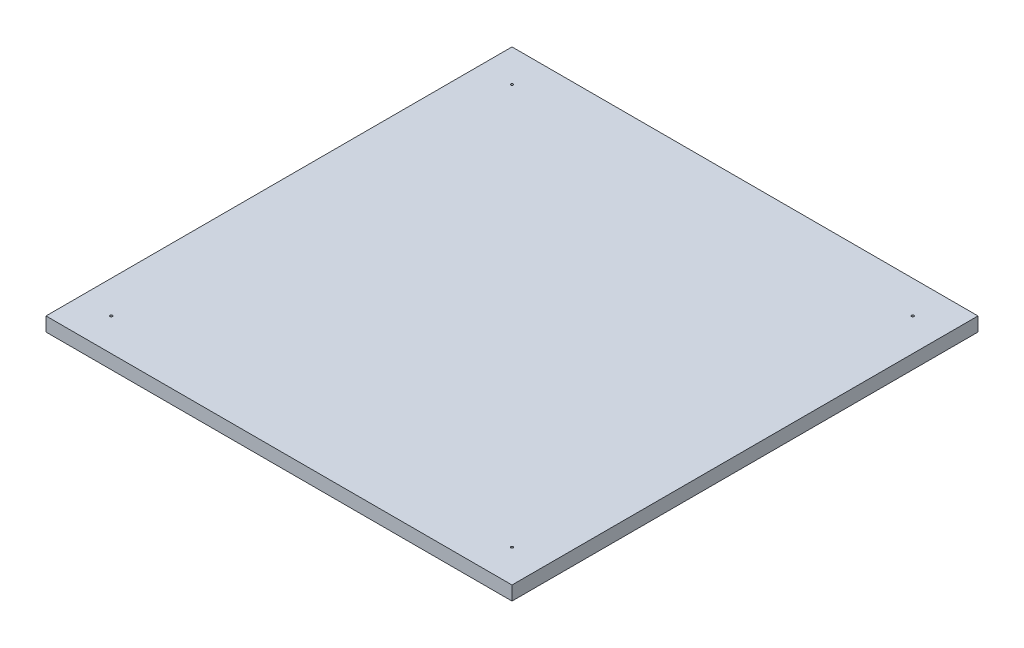
ISO-10303-21;
HEADER;
FILE_DESCRIPTION(('STEP AP214'),'2;1');
FILE_NAME('part.step','',(''),(''),'','','');
FILE_SCHEMA(('AUTOMOTIVE_DESIGN { 1 0 10303 214 1 1 1 1 }'));
ENDSEC;
DATA;
#1=APPLICATION_CONTEXT('core data for automotive mechanical design processes');
#2=APPLICATION_PROTOCOL_DEFINITION('international standard','automotive_design',2000,#1);
#3=PRODUCT_CONTEXT('',#1,'mechanical');
#4=PRODUCT('Part','Part','',(#3));
#5=PRODUCT_RELATED_PRODUCT_CATEGORY('part','',(#4));
#6=PRODUCT_DEFINITION_FORMATION('','',#4);
#7=PRODUCT_DEFINITION_CONTEXT('part definition',#1,'design');
#8=PRODUCT_DEFINITION('design','',#6,#7);
#9=PRODUCT_DEFINITION_SHAPE('','',#8);
#10=(LENGTH_UNIT() NAMED_UNIT(*) SI_UNIT(.MILLI.,.METRE.));
#11=(NAMED_UNIT(*) PLANE_ANGLE_UNIT() SI_UNIT($,.RADIAN.));
#12=(NAMED_UNIT(*) SI_UNIT($,.STERADIAN.) SOLID_ANGLE_UNIT());
#13=UNCERTAINTY_MEASURE_WITH_UNIT(LENGTH_MEASURE(1.E-05),#10,'distance_accuracy_value','');
#14=(GEOMETRIC_REPRESENTATION_CONTEXT(3) GLOBAL_UNCERTAINTY_ASSIGNED_CONTEXT((#13)) GLOBAL_UNIT_ASSIGNED_CONTEXT((#10,
#11,#12)) REPRESENTATION_CONTEXT('',''));
#15=CARTESIAN_POINT('',(0.,0.,0.));
#16=DIRECTION('',(0.,0.,1.));
#17=DIRECTION('',(1.,0.,0.));
#18=AXIS2_PLACEMENT_3D('',#15,#16,#17);
#19=CARTESIAN_POINT('',(500.,30.,0.));
#20=DIRECTION('',(0.,0.,-1.));
#21=DIRECTION('',(0.,1.,0.));
#22=AXIS2_PLACEMENT_3D('',#19,#20,#21);
#23=PLANE('',#22);
#24=DIRECTION('',(0.,-1.,0.));
#25=VECTOR('',#24,1.);
#26=CARTESIAN_POINT('',(-500.,30.,0.));
#27=LINE('',#26,#25);
#28=CARTESIAN_POINT('',(-500.,30.,0.));
#29=VERTEX_POINT('',#28);
#30=CARTESIAN_POINT('',(-500.,0.,0.));
#31=VERTEX_POINT('',#30);
#32=EDGE_CURVE('E97',#29,#31,#27,.T.);
#33=ORIENTED_EDGE('',*,*,#32,.T.);
#34=DIRECTION('',(-1.,0.,0.));
#35=VECTOR('',#34,1.);
#36=CARTESIAN_POINT('',(500.,0.,0.));
#37=LINE('',#36,#35);
#38=CARTESIAN_POINT('',(500.,0.,0.));
#39=VERTEX_POINT('',#38);
#40=EDGE_CURVE('E11',#39,#31,#37,.T.);
#41=ORIENTED_EDGE('',*,*,#40,.F.);
#42=DIRECTION('',(0.,-1.,0.));
#43=VECTOR('',#42,1.);
#44=CARTESIAN_POINT('',(500.,30.,0.));
#45=LINE('',#44,#43);
#46=CARTESIAN_POINT('',(500.,30.,0.));
#47=VERTEX_POINT('',#46);
#48=EDGE_CURVE('E85',#47,#39,#45,.T.);
#49=ORIENTED_EDGE('',*,*,#48,.F.);
#50=DIRECTION('',(-1.,0.,0.));
#51=VECTOR('',#50,1.);
#52=CARTESIAN_POINT('',(500.,30.,0.));
#53=LINE('',#52,#51);
#54=EDGE_CURVE('E93',#47,#29,#53,.T.);
#55=ORIENTED_EDGE('',*,*,#54,.T.);
#56=EDGE_LOOP('',(#33,#41,#49,#55));
#57=FACE_BOUND('',#56,.T.);
#58=ADVANCED_FACE('F34',(#57),#23,.F.);
#59=CARTESIAN_POINT('',(500.,0.,0.));
#60=DIRECTION('',(0.,1.,0.));
#61=DIRECTION('',(0.,0.,1.));
#62=AXIS2_PLACEMENT_3D('',#59,#60,#61);
#63=PLANE('',#62);
#64=DIRECTION('',(0.,0.,-1.));
#65=VECTOR('',#64,1.);
#66=CARTESIAN_POINT('',(-500.,0.,0.));
#67=LINE('',#66,#65);
#68=CARTESIAN_POINT('',(-500.,0.,-1000.));
#69=VERTEX_POINT('',#68);
#70=EDGE_CURVE('E89',#31,#69,#67,.T.);
#71=ORIENTED_EDGE('',*,*,#70,.T.);
#72=DIRECTION('',(-1.,0.,0.));
#73=VECTOR('',#72,1.);
#74=CARTESIAN_POINT('',(500.,0.,-1000.));
#75=LINE('',#74,#73);
#76=CARTESIAN_POINT('',(500.,0.,-1000.));
#77=VERTEX_POINT('',#76);
#78=EDGE_CURVE('E42',#77,#69,#75,.T.);
#79=ORIENTED_EDGE('',*,*,#78,.F.);
#80=DIRECTION('',(0.,0.,-1.));
#81=VECTOR('',#80,1.);
#82=CARTESIAN_POINT('',(500.,0.,0.));
#83=LINE('',#82,#81);
#84=EDGE_CURVE('E80',#39,#77,#83,.T.);
#85=ORIENTED_EDGE('',*,*,#84,.F.);
#86=ORIENTED_EDGE('',*,*,#40,.T.);
#87=EDGE_LOOP('',(#71,#79,#85,#86));
#88=FACE_BOUND('',#87,.T.);
#89=ADVANCED_FACE('F88',(#88),#63,.F.);
#90=CARTESIAN_POINT('',(500.,30.0000000000001,-1000.));
#91=DIRECTION('',(0.,0.,1.));
#92=DIRECTION('',(1.,0.,0.));
#93=AXIS2_PLACEMENT_3D('',#90,#91,#92);
#94=PLANE('',#93);
#95=DIRECTION('',(0.,1.,0.));
#96=VECTOR('',#95,1.);
#97=CARTESIAN_POINT('',(-500.,30.0000000000001,-1000.));
#98=LINE('',#97,#96);
#99=CARTESIAN_POINT('',(-500.,30.0000000000001,-1000.));
#100=VERTEX_POINT('',#99);
#101=EDGE_CURVE('E67',#69,#100,#98,.T.);
#102=ORIENTED_EDGE('',*,*,#101,.T.);
#103=DIRECTION('',(-1.,0.,0.));
#104=VECTOR('',#103,1.);
#105=CARTESIAN_POINT('',(500.,30.0000000000001,-1000.));
#106=LINE('',#105,#104);
#107=CARTESIAN_POINT('',(500.,30.0000000000001,-1000.));
#108=VERTEX_POINT('',#107);
#109=EDGE_CURVE('E90',#108,#100,#106,.T.);
#110=ORIENTED_EDGE('',*,*,#109,.F.);
#111=DIRECTION('',(0.,1.,0.));
#112=VECTOR('',#111,1.);
#113=CARTESIAN_POINT('',(500.,30.0000000000001,-1000.));
#114=LINE('',#113,#112);
#115=EDGE_CURVE('E83',#77,#108,#114,.T.);
#116=ORIENTED_EDGE('',*,*,#115,.F.);
#117=ORIENTED_EDGE('',*,*,#78,.T.);
#118=EDGE_LOOP('',(#102,#110,#116,#117));
#119=FACE_BOUND('',#118,.T.);
#120=ADVANCED_FACE('F91',(#119),#94,.F.);
#121=CARTESIAN_POINT('',(500.,30.0000000000001,-1000.));
#122=DIRECTION('',(0.,-1.,0.));
#123=DIRECTION('',(0.,0.,-1.));
#124=AXIS2_PLACEMENT_3D('',#121,#122,#123);
#125=PLANE('',#124);
#126=CARTESIAN_POINT('',(430.,30.,-70.0000000000001));
#127=DIRECTION('',(0.,1.,0.));
#128=DIRECTION('',(0.,0.,1.));
#129=AXIS2_PLACEMENT_3D('',#126,#127,#128);
#130=CIRCLE('',#129,2.50000000000002);
#131=CARTESIAN_POINT('',(430.,30.,-67.5));
#132=VERTEX_POINT('',#131);
#133=EDGE_CURVE('E129',#132,#132,#130,.T.);
#134=ORIENTED_EDGE('',*,*,#133,.F.);
#135=EDGE_LOOP('',(#134));
#136=FACE_BOUND('',#135,.T.);
#137=CARTESIAN_POINT('',(430.,30.0000000000001,-930.));
#138=DIRECTION('',(0.,1.,0.));
#139=DIRECTION('',(0.,0.,1.));
#140=AXIS2_PLACEMENT_3D('',#137,#138,#139);
#141=CIRCLE('',#140,2.50000000000002);
#142=CARTESIAN_POINT('',(430.,30.0000000000001,-927.5));
#143=VERTEX_POINT('',#142);
#144=EDGE_CURVE('E123',#143,#143,#141,.T.);
#145=ORIENTED_EDGE('',*,*,#144,.F.);
#146=EDGE_LOOP('',(#145));
#147=FACE_BOUND('',#146,.T.);
#148=CARTESIAN_POINT('',(-430.,30.0000000000001,-930.));
#149=DIRECTION('',(0.,1.,0.));
#150=DIRECTION('',(0.,0.,1.));
#151=AXIS2_PLACEMENT_3D('',#148,#149,#150);
#152=CIRCLE('',#151,2.50000000000002);
#153=CARTESIAN_POINT('',(-430.,30.0000000000001,-927.5));
#154=VERTEX_POINT('',#153);
#155=EDGE_CURVE('E117',#154,#154,#152,.T.);
#156=ORIENTED_EDGE('',*,*,#155,.F.);
#157=EDGE_LOOP('',(#156));
#158=FACE_BOUND('',#157,.T.);
#159=CARTESIAN_POINT('',(-430.,30.,-70.));
#160=DIRECTION('',(0.,1.,0.));
#161=DIRECTION('',(0.,0.,1.));
#162=AXIS2_PLACEMENT_3D('',#159,#160,#161);
#163=CIRCLE('',#162,2.50000000000002);
#164=CARTESIAN_POINT('',(-430.,30.,-67.5));
#165=VERTEX_POINT('',#164);
#166=EDGE_CURVE('E111',#165,#165,#163,.T.);
#167=ORIENTED_EDGE('',*,*,#166,.F.);
#168=EDGE_LOOP('',(#167));
#169=FACE_BOUND('',#168,.T.);
#170=DIRECTION('',(0.,0.,1.));
#171=VECTOR('',#170,1.);
#172=CARTESIAN_POINT('',(-500.,30.0000000000001,-1000.));
#173=LINE('',#172,#171);
#174=EDGE_CURVE('E73',#100,#29,#173,.T.);
#175=ORIENTED_EDGE('',*,*,#174,.T.);
#176=ORIENTED_EDGE('',*,*,#54,.F.);
#177=DIRECTION('',(0.,0.,1.));
#178=VECTOR('',#177,1.);
#179=CARTESIAN_POINT('',(500.,30.0000000000001,-1000.));
#180=LINE('',#179,#178);
#181=EDGE_CURVE('E50',#108,#47,#180,.T.);
#182=ORIENTED_EDGE('',*,*,#181,.F.);
#183=ORIENTED_EDGE('',*,*,#109,.T.);
#184=EDGE_LOOP('',(#175,#176,#182,#183));
#185=FACE_BOUND('',#184,.T.);
#186=ADVANCED_FACE('F105',(#136,#147,#158,#169,#185),#125,.F.);
#187=CARTESIAN_POINT('',(500.,0.,0.));
#188=DIRECTION('',(1.,0.,0.));
#189=DIRECTION('',(0.,0.,-1.));
#190=AXIS2_PLACEMENT_3D('',#187,#188,#189);
#191=PLANE('',#190);
#192=ORIENTED_EDGE('',*,*,#48,.T.);
#193=ORIENTED_EDGE('',*,*,#84,.T.);
#194=ORIENTED_EDGE('',*,*,#115,.T.);
#195=ORIENTED_EDGE('',*,*,#181,.T.);
#196=EDGE_LOOP('',(#192,#193,#194,#195));
#197=FACE_BOUND('',#196,.T.);
#198=ADVANCED_FACE('F81',(#197),#191,.T.);
#199=CARTESIAN_POINT('',(-500.,0.,0.));
#200=DIRECTION('',(1.,0.,0.));
#201=DIRECTION('',(0.,0.,-1.));
#202=AXIS2_PLACEMENT_3D('',#199,#200,#201);
#203=PLANE('',#202);
#204=ORIENTED_EDGE('',*,*,#32,.F.);
#205=ORIENTED_EDGE('',*,*,#174,.F.);
#206=ORIENTED_EDGE('',*,*,#101,.F.);
#207=ORIENTED_EDGE('',*,*,#70,.F.);
#208=EDGE_LOOP('',(#204,#205,#206,#207));
#209=FACE_BOUND('',#208,.T.);
#210=ADVANCED_FACE('F108',(#209),#203,.F.);
#211=CARTESIAN_POINT('',(-430.,25.,-70.));
#212=DIRECTION('',(0.,1.,0.));
#213=DIRECTION('',(0.,0.,1.));
#214=AXIS2_PLACEMENT_3D('',#211,#212,#213);
#215=CYLINDRICAL_SURFACE('',#214,2.50000000000002);
#216=CARTESIAN_POINT('',(-430.,25.,-70.));
#217=DIRECTION('',(0.,1.,0.));
#218=DIRECTION('',(0.,0.,1.));
#219=AXIS2_PLACEMENT_3D('',#216,#217,#218);
#220=CIRCLE('',#219,2.50000000000002);
#221=CARTESIAN_POINT('',(-430.,25.,-67.5));
#222=VERTEX_POINT('',#221);
#223=EDGE_CURVE('E100',#222,#222,#220,.T.);
#224=ORIENTED_EDGE('',*,*,#223,.F.);
#225=EDGE_LOOP('',(#224));
#226=FACE_BOUND('',#225,.T.);
#227=ORIENTED_EDGE('',*,*,#166,.T.);
#228=EDGE_LOOP('',(#227));
#229=FACE_BOUND('',#228,.T.);
#230=ADVANCED_FACE('F153',(#226,#229),#215,.F.);
#231=CARTESIAN_POINT('',(-430.,25.,-70.));
#232=DIRECTION('',(0.,1.,0.));
#233=DIRECTION('',(0.,0.,1.));
#234=AXIS2_PLACEMENT_3D('',#231,#232,#233);
#235=PLANE('',#234);
#236=ORIENTED_EDGE('',*,*,#223,.T.);
#237=EDGE_LOOP('',(#236));
#238=FACE_BOUND('',#237,.T.);
#239=ADVANCED_FACE('F155',(#238),#235,.T.);
#240=CARTESIAN_POINT('',(-430.,25.0000000000001,-930.));
#241=DIRECTION('',(0.,1.,0.));
#242=DIRECTION('',(0.,0.,1.));
#243=AXIS2_PLACEMENT_3D('',#240,#241,#242);
#244=CYLINDRICAL_SURFACE('',#243,2.50000000000002);
#245=CARTESIAN_POINT('',(-430.,25.0000000000001,-930.));
#246=DIRECTION('',(0.,1.,0.));
#247=DIRECTION('',(0.,0.,1.));
#248=AXIS2_PLACEMENT_3D('',#245,#246,#247);
#249=CIRCLE('',#248,2.50000000000002);
#250=CARTESIAN_POINT('',(-430.,25.0000000000001,-927.5));
#251=VERTEX_POINT('',#250);
#252=EDGE_CURVE('E114',#251,#251,#249,.T.);
#253=ORIENTED_EDGE('',*,*,#252,.F.);
#254=EDGE_LOOP('',(#253));
#255=FACE_BOUND('',#254,.T.);
#256=ORIENTED_EDGE('',*,*,#155,.T.);
#257=EDGE_LOOP('',(#256));
#258=FACE_BOUND('',#257,.T.);
#259=ADVANCED_FACE('F162',(#255,#258),#244,.F.);
#260=CARTESIAN_POINT('',(-430.,25.0000000000001,-930.));
#261=DIRECTION('',(0.,1.,0.));
#262=DIRECTION('',(0.,0.,1.));
#263=AXIS2_PLACEMENT_3D('',#260,#261,#262);
#264=PLANE('',#263);
#265=ORIENTED_EDGE('',*,*,#252,.T.);
#266=EDGE_LOOP('',(#265));
#267=FACE_BOUND('',#266,.T.);
#268=ADVANCED_FACE('F210',(#267),#264,.T.);
#269=CARTESIAN_POINT('',(430.,25.0000000000001,-930.));
#270=DIRECTION('',(0.,1.,0.));
#271=DIRECTION('',(0.,0.,1.));
#272=AXIS2_PLACEMENT_3D('',#269,#270,#271);
#273=CYLINDRICAL_SURFACE('',#272,2.50000000000002);
#274=CARTESIAN_POINT('',(430.,25.0000000000001,-930.));
#275=DIRECTION('',(0.,1.,0.));
#276=DIRECTION('',(0.,0.,1.));
#277=AXIS2_PLACEMENT_3D('',#274,#275,#276);
#278=CIRCLE('',#277,2.50000000000002);
#279=CARTESIAN_POINT('',(430.,25.0000000000001,-927.5));
#280=VERTEX_POINT('',#279);
#281=EDGE_CURVE('E120',#280,#280,#278,.T.);
#282=ORIENTED_EDGE('',*,*,#281,.F.);
#283=EDGE_LOOP('',(#282));
#284=FACE_BOUND('',#283,.T.);
#285=ORIENTED_EDGE('',*,*,#144,.T.);
#286=EDGE_LOOP('',(#285));
#287=FACE_BOUND('',#286,.T.);
#288=ADVANCED_FACE('F220',(#284,#287),#273,.F.);
#289=CARTESIAN_POINT('',(430.,25.0000000000001,-930.));
#290=DIRECTION('',(0.,1.,0.));
#291=DIRECTION('',(0.,0.,1.));
#292=AXIS2_PLACEMENT_3D('',#289,#290,#291);
#293=PLANE('',#292);
#294=ORIENTED_EDGE('',*,*,#281,.T.);
#295=EDGE_LOOP('',(#294));
#296=FACE_BOUND('',#295,.T.);
#297=ADVANCED_FACE('F140',(#296),#293,.T.);
#298=CARTESIAN_POINT('',(430.,25.,-70.0000000000001));
#299=DIRECTION('',(0.,1.,0.));
#300=DIRECTION('',(0.,0.,1.));
#301=AXIS2_PLACEMENT_3D('',#298,#299,#300);
#302=CYLINDRICAL_SURFACE('',#301,2.50000000000002);
#303=CARTESIAN_POINT('',(430.,25.,-70.0000000000001));
#304=DIRECTION('',(0.,1.,0.));
#305=DIRECTION('',(0.,0.,1.));
#306=AXIS2_PLACEMENT_3D('',#303,#304,#305);
#307=CIRCLE('',#306,2.50000000000002);
#308=CARTESIAN_POINT('',(430.,25.,-67.5));
#309=VERTEX_POINT('',#308);
#310=EDGE_CURVE('E126',#309,#309,#307,.T.);
#311=ORIENTED_EDGE('',*,*,#310,.F.);
#312=EDGE_LOOP('',(#311));
#313=FACE_BOUND('',#312,.T.);
#314=ORIENTED_EDGE('',*,*,#133,.T.);
#315=EDGE_LOOP('',(#314));
#316=FACE_BOUND('',#315,.T.);
#317=ADVANCED_FACE('F137',(#313,#316),#302,.F.);
#318=CARTESIAN_POINT('',(430.,25.,-70.0000000000001));
#319=DIRECTION('',(0.,1.,0.));
#320=DIRECTION('',(0.,0.,1.));
#321=AXIS2_PLACEMENT_3D('',#318,#319,#320);
#322=PLANE('',#321);
#323=ORIENTED_EDGE('',*,*,#310,.T.);
#324=EDGE_LOOP('',(#323));
#325=FACE_BOUND('',#324,.T.);
#326=ADVANCED_FACE('F135',(#325),#322,.T.);
#327=CLOSED_SHELL('',(#58,#89,#120,#186,#198,#210,#230,#239,#259,#268,#288,#297,#317,#326));
#328=MANIFOLD_SOLID_BREP('B2',#327);
#329=ADVANCED_BREP_SHAPE_REPRESENTATION('',(#18,#328),#14);
#330=SHAPE_DEFINITION_REPRESENTATION(#9,#329);
ENDSEC;
END-ISO-10303-21;
